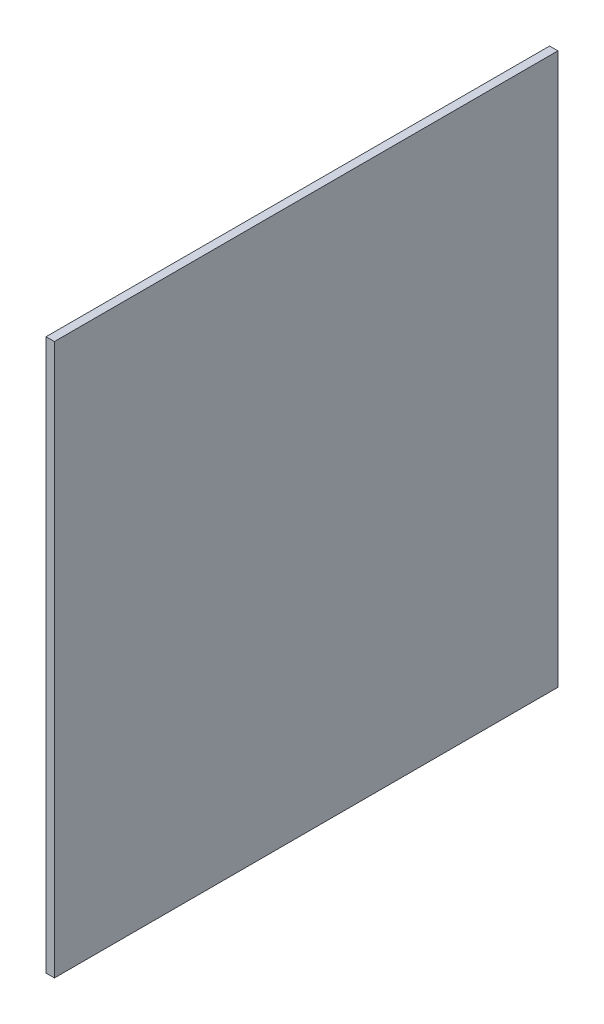
ISO-10303-21;
HEADER;
FILE_DESCRIPTION(('STEP AP214'),'2;1');
FILE_NAME('part.step','',(''),(''),'','','');
FILE_SCHEMA(('AUTOMOTIVE_DESIGN { 1 0 10303 214 1 1 1 1 }'));
ENDSEC;
DATA;
#1=APPLICATION_CONTEXT('core data for automotive mechanical design processes');
#2=APPLICATION_PROTOCOL_DEFINITION('international standard','automotive_design',2000,#1);
#3=PRODUCT_CONTEXT('',#1,'mechanical');
#4=PRODUCT('Part','Part','',(#3));
#5=PRODUCT_RELATED_PRODUCT_CATEGORY('part','',(#4));
#6=PRODUCT_DEFINITION_FORMATION('','',#4);
#7=PRODUCT_DEFINITION_CONTEXT('part definition',#1,'design');
#8=PRODUCT_DEFINITION('design','',#6,#7);
#9=PRODUCT_DEFINITION_SHAPE('','',#8);
#10=(LENGTH_UNIT() NAMED_UNIT(*) SI_UNIT(.MILLI.,.METRE.));
#11=(NAMED_UNIT(*) PLANE_ANGLE_UNIT() SI_UNIT($,.RADIAN.));
#12=(NAMED_UNIT(*) SI_UNIT($,.STERADIAN.) SOLID_ANGLE_UNIT());
#13=UNCERTAINTY_MEASURE_WITH_UNIT(LENGTH_MEASURE(1.E-05),#10,'distance_accuracy_value','');
#14=(GEOMETRIC_REPRESENTATION_CONTEXT(3) GLOBAL_UNCERTAINTY_ASSIGNED_CONTEXT((#13)) GLOBAL_UNIT_ASSIGNED_CONTEXT((#10,
#11,#12)) REPRESENTATION_CONTEXT('',''));
#15=CARTESIAN_POINT('',(0.,0.,0.));
#16=DIRECTION('',(0.,0.,1.));
#17=DIRECTION('',(1.,0.,0.));
#18=AXIS2_PLACEMENT_3D('',#15,#16,#17);
#19=CARTESIAN_POINT('',(2235.2,381.,-370.48708012253));
#20=DIRECTION('',(1.,0.,0.));
#21=DIRECTION('',(0.,0.,-1.));
#22=AXIS2_PLACEMENT_3D('',#19,#20,#21);
#23=PLANE('',#22);
#24=DIRECTION('',(0.,0.,1.));
#25=VECTOR('',#24,1.);
#26=CARTESIAN_POINT('',(2235.2,-457.2,-370.48708012253));
#27=LINE('',#26,#25);
#28=CARTESIAN_POINT('',(2235.2,-457.2,-370.48708012253));
#29=VERTEX_POINT('',#28);
#30=CARTESIAN_POINT('',(2235.2,-457.2,395.205409913913));
#31=VERTEX_POINT('',#30);
#32=EDGE_CURVE('E109',#29,#31,#27,.T.);
#33=ORIENTED_EDGE('',*,*,#32,.T.);
#34=DIRECTION('',(0.,-1.,0.));
#35=VECTOR('',#34,1.);
#36=CARTESIAN_POINT('',(2235.2,381.,395.205409913913));
#37=LINE('',#36,#35);
#38=CARTESIAN_POINT('',(2235.2,381.,395.205409913913));
#39=VERTEX_POINT('',#38);
#40=EDGE_CURVE('E11',#39,#31,#37,.T.);
#41=ORIENTED_EDGE('',*,*,#40,.F.);
#42=DIRECTION('',(0.,0.,1.));
#43=VECTOR('',#42,1.);
#44=CARTESIAN_POINT('',(2235.2,381.,-370.48708012253));
#45=LINE('',#44,#43);
#46=CARTESIAN_POINT('',(2235.2,381.,-370.48708012253));
#47=VERTEX_POINT('',#46);
#48=EDGE_CURVE('E93',#47,#39,#45,.T.);
#49=ORIENTED_EDGE('',*,*,#48,.F.);
#50=DIRECTION('',(0.,-1.,0.));
#51=VECTOR('',#50,1.);
#52=CARTESIAN_POINT('',(2235.2,381.,-370.48708012253));
#53=LINE('',#52,#51);
#54=EDGE_CURVE('E105',#47,#29,#53,.T.);
#55=ORIENTED_EDGE('',*,*,#54,.T.);
#56=EDGE_LOOP('',(#33,#41,#49,#55));
#57=FACE_BOUND('',#56,.T.);
#58=ADVANCED_FACE('F41',(#57),#23,.F.);
#59=CARTESIAN_POINT('',(2235.2,381.,395.205409913913));
#60=DIRECTION('',(0.,0.,-1.));
#61=DIRECTION('',(-1.,0.,0.));
#62=AXIS2_PLACEMENT_3D('',#59,#60,#61);
#63=PLANE('',#62);
#64=DIRECTION('',(1.,0.,0.));
#65=VECTOR('',#64,1.);
#66=CARTESIAN_POINT('',(2235.2,-457.2,395.205409913913));
#67=LINE('',#66,#65);
#68=CARTESIAN_POINT('',(2247.9,-457.2,395.205409913913));
#69=VERTEX_POINT('',#68);
#70=EDGE_CURVE('E97',#31,#69,#67,.T.);
#71=ORIENTED_EDGE('',*,*,#70,.T.);
#72=DIRECTION('',(0.,-1.,0.));
#73=VECTOR('',#72,1.);
#74=CARTESIAN_POINT('',(2247.9,381.,395.205409913913));
#75=LINE('',#74,#73);
#76=CARTESIAN_POINT('',(2247.9,381.,395.205409913913));
#77=VERTEX_POINT('',#76);
#78=EDGE_CURVE('E50',#77,#69,#75,.T.);
#79=ORIENTED_EDGE('',*,*,#78,.F.);
#80=DIRECTION('',(1.,0.,0.));
#81=VECTOR('',#80,1.);
#82=CARTESIAN_POINT('',(2235.2,381.,395.205409913913));
#83=LINE('',#82,#81);
#84=EDGE_CURVE('E88',#39,#77,#83,.T.);
#85=ORIENTED_EDGE('',*,*,#84,.F.);
#86=ORIENTED_EDGE('',*,*,#40,.T.);
#87=EDGE_LOOP('',(#71,#79,#85,#86));
#88=FACE_BOUND('',#87,.T.);
#89=ADVANCED_FACE('F96',(#88),#63,.F.);
#90=CARTESIAN_POINT('',(2247.9,381.,-370.48708012253));
#91=DIRECTION('',(-1.,0.,0.));
#92=DIRECTION('',(0.,0.,1.));
#93=AXIS2_PLACEMENT_3D('',#90,#91,#92);
#94=PLANE('',#93);
#95=DIRECTION('',(0.,0.,-1.));
#96=VECTOR('',#95,1.);
#97=CARTESIAN_POINT('',(2247.9,-457.2,-370.48708012253));
#98=LINE('',#97,#96);
#99=CARTESIAN_POINT('',(2247.9,-457.2,-370.48708012253));
#100=VERTEX_POINT('',#99);
#101=EDGE_CURVE('E75',#69,#100,#98,.T.);
#102=ORIENTED_EDGE('',*,*,#101,.T.);
#103=DIRECTION('',(0.,-1.,0.));
#104=VECTOR('',#103,1.);
#105=CARTESIAN_POINT('',(2247.9,381.,-370.48708012253));
#106=LINE('',#105,#104);
#107=CARTESIAN_POINT('',(2247.9,381.,-370.48708012253));
#108=VERTEX_POINT('',#107);
#109=EDGE_CURVE('E99',#108,#100,#106,.T.);
#110=ORIENTED_EDGE('',*,*,#109,.F.);
#111=DIRECTION('',(0.,0.,-1.));
#112=VECTOR('',#111,1.);
#113=CARTESIAN_POINT('',(2247.9,381.,-370.48708012253));
#114=LINE('',#113,#112);
#115=EDGE_CURVE('E91',#77,#108,#114,.T.);
#116=ORIENTED_EDGE('',*,*,#115,.F.);
#117=ORIENTED_EDGE('',*,*,#78,.T.);
#118=EDGE_LOOP('',(#102,#110,#116,#117));
#119=FACE_BOUND('',#118,.T.);
#120=ADVANCED_FACE('F100',(#119),#94,.F.);
#121=CARTESIAN_POINT('',(2235.2,381.,-370.48708012253));
#122=DIRECTION('',(0.,0.,1.));
#123=DIRECTION('',(1.,0.,0.));
#124=AXIS2_PLACEMENT_3D('',#121,#122,#123);
#125=PLANE('',#124);
#126=DIRECTION('',(-1.,0.,0.));
#127=VECTOR('',#126,1.);
#128=CARTESIAN_POINT('',(2235.2,-457.2,-370.48708012253));
#129=LINE('',#128,#127);
#130=EDGE_CURVE('E81',#100,#29,#129,.T.);
#131=ORIENTED_EDGE('',*,*,#130,.T.);
#132=ORIENTED_EDGE('',*,*,#54,.F.);
#133=DIRECTION('',(-1.,0.,0.));
#134=VECTOR('',#133,1.);
#135=CARTESIAN_POINT('',(2235.2,381.,-370.48708012253));
#136=LINE('',#135,#134);
#137=EDGE_CURVE('E58',#108,#47,#136,.T.);
#138=ORIENTED_EDGE('',*,*,#137,.F.);
#139=ORIENTED_EDGE('',*,*,#109,.T.);
#140=EDGE_LOOP('',(#131,#132,#138,#139));
#141=FACE_BOUND('',#140,.T.);
#142=ADVANCED_FACE('F117',(#141),#125,.F.);
#143=CARTESIAN_POINT('',(0.,381.,0.));
#144=DIRECTION('',(0.,1.,0.));
#145=DIRECTION('',(0.,0.,1.));
#146=AXIS2_PLACEMENT_3D('',#143,#144,#145);
#147=PLANE('',#146);
#148=ORIENTED_EDGE('',*,*,#48,.T.);
#149=ORIENTED_EDGE('',*,*,#84,.T.);
#150=ORIENTED_EDGE('',*,*,#115,.T.);
#151=ORIENTED_EDGE('',*,*,#137,.T.);
#152=EDGE_LOOP('',(#148,#149,#150,#151));
#153=FACE_BOUND('',#152,.T.);
#154=ADVANCED_FACE('F89',(#153),#147,.T.);
#155=CARTESIAN_POINT('',(0.,-457.2,0.));
#156=DIRECTION('',(0.,1.,0.));
#157=DIRECTION('',(0.,0.,1.));
#158=AXIS2_PLACEMENT_3D('',#155,#156,#157);
#159=PLANE('',#158);
#160=ORIENTED_EDGE('',*,*,#32,.F.);
#161=ORIENTED_EDGE('',*,*,#130,.F.);
#162=ORIENTED_EDGE('',*,*,#101,.F.);
#163=ORIENTED_EDGE('',*,*,#70,.F.);
#164=EDGE_LOOP('',(#160,#161,#162,#163));
#165=FACE_BOUND('',#164,.T.);
#166=ADVANCED_FACE('F120',(#165),#159,.F.);
#167=CLOSED_SHELL('',(#58,#89,#120,#142,#154,#166));
#168=MANIFOLD_SOLID_BREP('B2',#167);
#169=ADVANCED_BREP_SHAPE_REPRESENTATION('',(#18,#168),#14);
#170=SHAPE_DEFINITION_REPRESENTATION(#9,#169);
ENDSEC;
END-ISO-10303-21;
